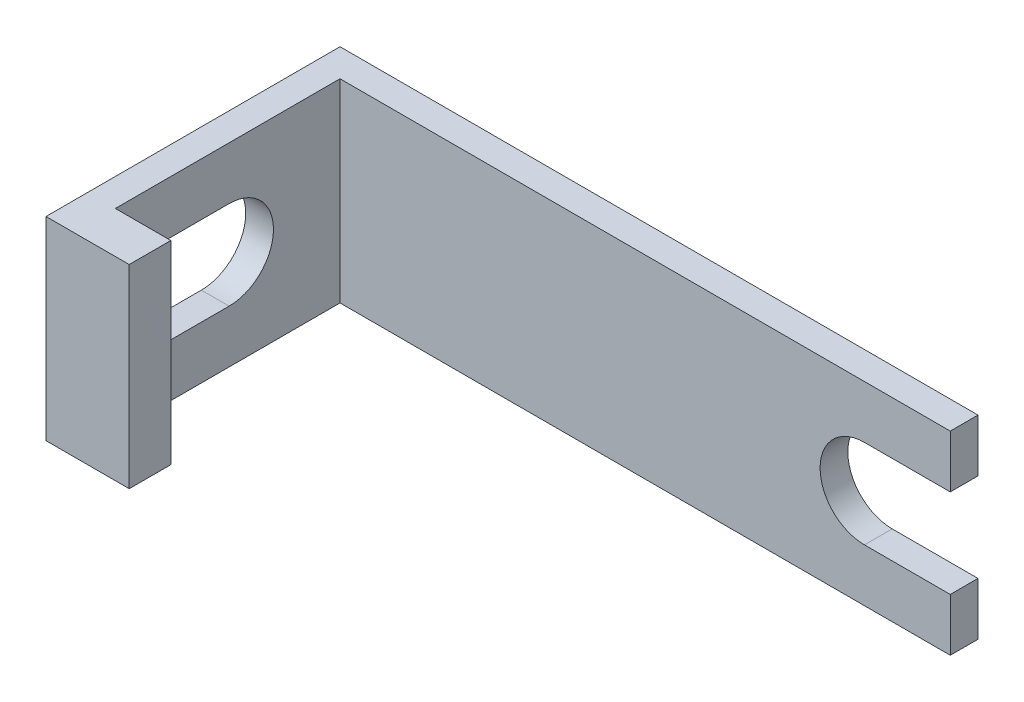
ISO-10303-21;
HEADER;
FILE_DESCRIPTION(('STEP AP214'),'2;1');
FILE_NAME('part.step','',(''),(''),'','','');
FILE_SCHEMA(('AUTOMOTIVE_DESIGN { 1 0 10303 214 1 1 1 1 }'));
ENDSEC;
DATA;
#1=APPLICATION_CONTEXT('core data for automotive mechanical design processes');
#2=APPLICATION_PROTOCOL_DEFINITION('international standard','automotive_design',2000,#1);
#3=PRODUCT_CONTEXT('',#1,'mechanical');
#4=PRODUCT('Part','Part','',(#3));
#5=PRODUCT_RELATED_PRODUCT_CATEGORY('part','',(#4));
#6=PRODUCT_DEFINITION_FORMATION('','',#4);
#7=PRODUCT_DEFINITION_CONTEXT('part definition',#1,'design');
#8=PRODUCT_DEFINITION('design','',#6,#7);
#9=PRODUCT_DEFINITION_SHAPE('','',#8);
#10=(LENGTH_UNIT() NAMED_UNIT(*) SI_UNIT(.MILLI.,.METRE.));
#11=(NAMED_UNIT(*) PLANE_ANGLE_UNIT() SI_UNIT($,.RADIAN.));
#12=(NAMED_UNIT(*) SI_UNIT($,.STERADIAN.) SOLID_ANGLE_UNIT());
#13=UNCERTAINTY_MEASURE_WITH_UNIT(LENGTH_MEASURE(1.E-05),#10,'distance_accuracy_value','');
#14=(GEOMETRIC_REPRESENTATION_CONTEXT(3) GLOBAL_UNCERTAINTY_ASSIGNED_CONTEXT((#13)) GLOBAL_UNIT_ASSIGNED_CONTEXT((#10,
#11,#12)) REPRESENTATION_CONTEXT('',''));
#15=CARTESIAN_POINT('',(0.,0.,0.));
#16=DIRECTION('',(0.,0.,1.));
#17=DIRECTION('',(1.,0.,0.));
#18=AXIS2_PLACEMENT_3D('',#15,#16,#17);
#19=CARTESIAN_POINT('',(12.700412833673,1.02264033263855,1.));
#20=DIRECTION('',(0.,0.,1.));
#21=DIRECTION('',(1.,0.,0.));
#22=AXIS2_PLACEMENT_3D('',#19,#20,#21);
#23=PLANE('',#22);
#24=DIRECTION('',(-1.,0.,0.));
#25=VECTOR('',#24,1.);
#26=CARTESIAN_POINT('',(15.7933647921131,4.52264033263895,1.));
#27=LINE('',#26,#25);
#28=CARTESIAN_POINT('',(15.7933647921131,4.52264033263895,1.));
#29=VERTEX_POINT('',#28);
#30=CARTESIAN_POINT('',(-6.20663520788689,4.52264033263895,1.));
#31=VERTEX_POINT('',#30);
#32=EDGE_CURVE('E219',#29,#31,#27,.T.);
#33=ORIENTED_EDGE('',*,*,#32,.T.);
#34=DIRECTION('',(0.,-1.,0.));
#35=VECTOR('',#34,1.);
#36=CARTESIAN_POINT('',(-6.20663520788689,1.02264033263854,1.));
#37=LINE('',#36,#35);
#38=CARTESIAN_POINT('',(-6.20663520788689,-2.47735966736105,1.));
#39=VERTEX_POINT('',#38);
#40=EDGE_CURVE('E216',#31,#39,#37,.T.);
#41=ORIENTED_EDGE('',*,*,#40,.T.);
#42=DIRECTION('',(1.,0.,0.));
#43=VECTOR('',#42,1.);
#44=CARTESIAN_POINT('',(-7.20663520788689,-2.47735966736105,1.));
#45=LINE('',#44,#43);
#46=CARTESIAN_POINT('',(15.7933647921131,-2.47735966736105,1.));
#47=VERTEX_POINT('',#46);
#48=EDGE_CURVE('E221',#39,#47,#45,.T.);
#49=ORIENTED_EDGE('',*,*,#48,.T.);
#50=DIRECTION('',(0.,1.,0.));
#51=VECTOR('',#50,1.);
#52=CARTESIAN_POINT('',(15.7933647921131,-0.577359667361056,1.));
#53=LINE('',#52,#51);
#54=CARTESIAN_POINT('',(15.7933647921131,-0.577359667361056,1.));
#55=VERTEX_POINT('',#54);
#56=EDGE_CURVE('E224',#47,#55,#53,.T.);
#57=ORIENTED_EDGE('',*,*,#56,.T.);
#58=DIRECTION('',(-1.,0.,0.));
#59=VECTOR('',#58,1.);
#60=CARTESIAN_POINT('',(13.620412833673,-0.577359667361056,1.));
#61=LINE('',#60,#59);
#62=CARTESIAN_POINT('',(12.700412833673,-0.577359667361056,1.));
#63=VERTEX_POINT('',#62);
#64=EDGE_CURVE('E226',#55,#63,#61,.T.);
#65=ORIENTED_EDGE('',*,*,#64,.T.);
#66=CARTESIAN_POINT('',(12.700412833673,1.02264033263855,1.));
#67=DIRECTION('',(0.,0.,-1.));
#68=DIRECTION('',(1.,0.,0.));
#69=AXIS2_PLACEMENT_3D('',#66,#67,#68);
#70=CIRCLE('',#69,1.5999999999996);
#71=CARTESIAN_POINT('',(12.700412833673,2.62264033263815,1.));
#72=VERTEX_POINT('',#71);
#73=EDGE_CURVE('E228',#63,#72,#70,.T.);
#74=ORIENTED_EDGE('',*,*,#73,.T.);
#75=DIRECTION('',(1.,0.,0.));
#76=VECTOR('',#75,1.);
#77=CARTESIAN_POINT('',(13.620412833673,2.62264033263815,1.));
#78=LINE('',#77,#76);
#79=CARTESIAN_POINT('',(15.7933647921131,2.62264033263815,1.));
#80=VERTEX_POINT('',#79);
#81=EDGE_CURVE('E230',#72,#80,#78,.T.);
#82=ORIENTED_EDGE('',*,*,#81,.T.);
#83=DIRECTION('',(0.,1.,0.));
#84=VECTOR('',#83,1.);
#85=CARTESIAN_POINT('',(15.7933647921131,4.52264033263895,1.));
#86=LINE('',#85,#84);
#87=EDGE_CURVE('E232',#80,#29,#86,.T.);
#88=ORIENTED_EDGE('',*,*,#87,.T.);
#89=EDGE_LOOP('',(#33,#41,#49,#57,#65,#74,#82,#88));
#90=FACE_BOUND('',#89,.T.);
#91=ADVANCED_FACE('F34',(#90),#23,.T.);
#92=CARTESIAN_POINT('',(15.7933647921131,4.52264033263895,1.));
#93=DIRECTION('',(0.,-1.,0.));
#94=DIRECTION('',(1.,0.,0.));
#95=AXIS2_PLACEMENT_3D('',#92,#93,#94);
#96=PLANE('',#95);
#97=DIRECTION('',(0.,0.,-1.));
#98=VECTOR('',#97,1.);
#99=CARTESIAN_POINT('',(-7.20663520788689,4.52264033263895,1.));
#100=LINE('',#99,#98);
#101=CARTESIAN_POINT('',(-7.20663520788689,4.52264033263895,10.6));
#102=VERTEX_POINT('',#101);
#103=CARTESIAN_POINT('',(-7.20663520788689,4.52264033263895,0.));
#104=VERTEX_POINT('',#103);
#105=EDGE_CURVE('E11',#102,#104,#100,.T.);
#106=ORIENTED_EDGE('',*,*,#105,.F.);
#107=DIRECTION('',(-1.,0.,0.));
#108=VECTOR('',#107,1.);
#109=CARTESIAN_POINT('',(-4.20663520788689,4.52264033263895,10.6));
#110=LINE('',#109,#108);
#111=CARTESIAN_POINT('',(-4.20663520788689,4.52264033263895,10.6));
#112=VERTEX_POINT('',#111);
#113=EDGE_CURVE('E200',#112,#102,#110,.T.);
#114=ORIENTED_EDGE('',*,*,#113,.F.);
#115=DIRECTION('',(0.,0.,-1.));
#116=VECTOR('',#115,1.);
#117=CARTESIAN_POINT('',(-4.20663520788689,4.52264033263895,9.1));
#118=LINE('',#117,#116);
#119=CARTESIAN_POINT('',(-4.20663520788689,4.52264033263895,9.1));
#120=VERTEX_POINT('',#119);
#121=EDGE_CURVE('E190',#112,#120,#118,.T.);
#122=ORIENTED_EDGE('',*,*,#121,.T.);
#123=DIRECTION('',(-1.,0.,0.));
#124=VECTOR('',#123,1.);
#125=CARTESIAN_POINT('',(-4.20663520788689,4.52264033263895,9.1));
#126=LINE('',#125,#124);
#127=CARTESIAN_POINT('',(-6.20663520788689,4.52264033263895,9.1));
#128=VERTEX_POINT('',#127);
#129=EDGE_CURVE('E196',#120,#128,#126,.T.);
#130=ORIENTED_EDGE('',*,*,#129,.T.);
#131=DIRECTION('',(0.,0.,-1.));
#132=VECTOR('',#131,1.);
#133=CARTESIAN_POINT('',(-6.20663520788689,4.52264033263895,0.));
#134=LINE('',#133,#132);
#135=EDGE_CURVE('E199',#128,#31,#134,.T.);
#136=ORIENTED_EDGE('',*,*,#135,.T.);
#137=ORIENTED_EDGE('',*,*,#32,.F.);
#138=DIRECTION('',(0.,0.,-1.));
#139=VECTOR('',#138,1.);
#140=CARTESIAN_POINT('',(15.7933647921131,4.52264033263895,1.));
#141=LINE('',#140,#139);
#142=CARTESIAN_POINT('',(15.7933647921131,4.52264033263895,0.));
#143=VERTEX_POINT('',#142);
#144=EDGE_CURVE('E234',#29,#143,#141,.T.);
#145=ORIENTED_EDGE('',*,*,#144,.T.);
#146=DIRECTION('',(-1.,0.,0.));
#147=VECTOR('',#146,1.);
#148=CARTESIAN_POINT('',(15.7933647921131,4.52264033263895,0.));
#149=LINE('',#148,#147);
#150=EDGE_CURVE('E218',#143,#104,#149,.T.);
#151=ORIENTED_EDGE('',*,*,#150,.T.);
#152=EDGE_LOOP('',(#106,#114,#122,#130,#136,#137,#145,#151));
#153=FACE_BOUND('',#152,.T.);
#154=ADVANCED_FACE('F36',(#153),#96,.F.);
#155=CARTESIAN_POINT('',(-7.20663520788689,4.52264033263895,1.));
#156=DIRECTION('',(1.,0.,0.));
#157=DIRECTION('',(0.,1.,0.));
#158=AXIS2_PLACEMENT_3D('',#155,#156,#157);
#159=PLANE('',#158);
#160=DIRECTION('',(0.,0.,-1.));
#161=VECTOR('',#160,1.);
#162=CARTESIAN_POINT('',(-7.20663520788689,2.62264033263895,7.5));
#163=LINE('',#162,#161);
#164=CARTESIAN_POINT('',(-7.20663520788689,2.62264033263895,7.5));
#165=VERTEX_POINT('',#164);
#166=CARTESIAN_POINT('',(-7.20663520788689,2.62264033263895,5.));
#167=VERTEX_POINT('',#166);
#168=EDGE_CURVE('E495',#165,#167,#163,.T.);
#169=ORIENTED_EDGE('',*,*,#168,.F.);
#170=CARTESIAN_POINT('',(-7.20663520788689,1.02264033263895,7.5));
#171=DIRECTION('',(1.,0.,0.));
#172=DIRECTION('',(0.,1.,0.));
#173=AXIS2_PLACEMENT_3D('',#170,#171,#172);
#174=CIRCLE('',#173,1.6);
#175=CARTESIAN_POINT('',(-7.20663520788689,-0.577359667361055,7.5));
#176=VERTEX_POINT('',#175);
#177=EDGE_CURVE('E180',#176,#165,#174,.F.);
#178=ORIENTED_EDGE('',*,*,#177,.F.);
#179=DIRECTION('',(0.,0.,1.));
#180=VECTOR('',#179,1.);
#181=CARTESIAN_POINT('',(-7.20663520788689,-0.577359667361055,7.5));
#182=LINE('',#181,#180);
#183=CARTESIAN_POINT('',(-7.20663520788689,-0.577359667361055,5.));
#184=VERTEX_POINT('',#183);
#185=EDGE_CURVE('E177',#184,#176,#182,.T.);
#186=ORIENTED_EDGE('',*,*,#185,.F.);
#187=CARTESIAN_POINT('',(-7.20663520788689,1.02264033263895,5.));
#188=DIRECTION('',(1.,0.,0.));
#189=DIRECTION('',(0.,1.,0.));
#190=AXIS2_PLACEMENT_3D('',#187,#188,#189);
#191=CIRCLE('',#190,1.6);
#192=EDGE_CURVE('E154',#167,#184,#191,.F.);
#193=ORIENTED_EDGE('',*,*,#192,.F.);
#194=EDGE_LOOP('',(#169,#178,#186,#193));
#195=FACE_BOUND('',#194,.T.);
#196=DIRECTION('',(0.,-1.,0.));
#197=VECTOR('',#196,1.);
#198=CARTESIAN_POINT('',(-7.20663520788689,4.52264033263895,0.));
#199=LINE('',#198,#197);
#200=CARTESIAN_POINT('',(-7.20663520788689,-2.47735966736105,0.));
#201=VERTEX_POINT('',#200);
#202=EDGE_CURVE('E236',#104,#201,#199,.T.);
#203=ORIENTED_EDGE('',*,*,#202,.T.);
#204=DIRECTION('',(0.,0.,-1.));
#205=VECTOR('',#204,1.);
#206=CARTESIAN_POINT('',(-7.20663520788689,-2.47735966736105,1.));
#207=LINE('',#206,#205);
#208=CARTESIAN_POINT('',(-7.20663520788689,-2.47735966736105,10.6));
#209=VERTEX_POINT('',#208);
#210=EDGE_CURVE('E42',#209,#201,#207,.T.);
#211=ORIENTED_EDGE('',*,*,#210,.F.);
#212=DIRECTION('',(0.,1.,0.));
#213=VECTOR('',#212,1.);
#214=CARTESIAN_POINT('',(-7.20663520788689,-2.47735966736105,10.6));
#215=LINE('',#214,#213);
#216=EDGE_CURVE('E179',#209,#102,#215,.T.);
#217=ORIENTED_EDGE('',*,*,#216,.T.);
#218=ORIENTED_EDGE('',*,*,#105,.T.);
#219=EDGE_LOOP('',(#203,#211,#217,#218));
#220=FACE_BOUND('',#219,.T.);
#221=ADVANCED_FACE('F308',(#195,#220),#159,.F.);
#222=CARTESIAN_POINT('',(-7.20663520788689,-2.47735966736105,1.));
#223=DIRECTION('',(0.,1.,0.));
#224=DIRECTION('',(-1.,0.,0.));
#225=AXIS2_PLACEMENT_3D('',#222,#223,#224);
#226=PLANE('',#225);
#227=DIRECTION('',(1.,0.,0.));
#228=VECTOR('',#227,1.);
#229=CARTESIAN_POINT('',(-7.20663520788689,-2.47735966736105,0.));
#230=LINE('',#229,#228);
#231=CARTESIAN_POINT('',(15.7933647921131,-2.47735966736105,0.));
#232=VERTEX_POINT('',#231);
#233=EDGE_CURVE('E238',#201,#232,#230,.T.);
#234=ORIENTED_EDGE('',*,*,#233,.T.);
#235=DIRECTION('',(0.,0.,-1.));
#236=VECTOR('',#235,1.);
#237=CARTESIAN_POINT('',(15.7933647921131,-2.47735966736105,1.));
#238=LINE('',#237,#236);
#239=EDGE_CURVE('E265',#47,#232,#238,.T.);
#240=ORIENTED_EDGE('',*,*,#239,.F.);
#241=ORIENTED_EDGE('',*,*,#48,.F.);
#242=DIRECTION('',(0.,0.,1.));
#243=VECTOR('',#242,1.);
#244=CARTESIAN_POINT('',(-6.20663520788689,-2.47735966736105,0.));
#245=LINE('',#244,#243);
#246=CARTESIAN_POINT('',(-6.20663520788689,-2.47735966736105,9.1));
#247=VERTEX_POINT('',#246);
#248=EDGE_CURVE('E210',#39,#247,#245,.T.);
#249=ORIENTED_EDGE('',*,*,#248,.T.);
#250=DIRECTION('',(-1.,0.,0.));
#251=VECTOR('',#250,1.);
#252=CARTESIAN_POINT('',(-4.20663520788689,-2.47735966736105,9.1));
#253=LINE('',#252,#251);
#254=CARTESIAN_POINT('',(-4.20663520788689,-2.47735966736105,9.1));
#255=VERTEX_POINT('',#254);
#256=EDGE_CURVE('E193',#255,#247,#253,.T.);
#257=ORIENTED_EDGE('',*,*,#256,.F.);
#258=DIRECTION('',(0.,0.,1.));
#259=VECTOR('',#258,1.);
#260=CARTESIAN_POINT('',(-4.20663520788689,-2.47735966736105,9.1));
#261=LINE('',#260,#259);
#262=CARTESIAN_POINT('',(-4.20663520788689,-2.47735966736105,10.6));
#263=VERTEX_POINT('',#262);
#264=EDGE_CURVE('E184',#255,#263,#261,.T.);
#265=ORIENTED_EDGE('',*,*,#264,.T.);
#266=DIRECTION('',(-1.,0.,0.));
#267=VECTOR('',#266,1.);
#268=CARTESIAN_POINT('',(-4.20663520788689,-2.47735966736105,10.6));
#269=LINE('',#268,#267);
#270=EDGE_CURVE('E203',#263,#209,#269,.T.);
#271=ORIENTED_EDGE('',*,*,#270,.T.);
#272=ORIENTED_EDGE('',*,*,#210,.T.);
#273=EDGE_LOOP('',(#234,#240,#241,#249,#257,#265,#271,#272));
#274=FACE_BOUND('',#273,.T.);
#275=ADVANCED_FACE('F270',(#274),#226,.F.);
#276=CARTESIAN_POINT('',(15.7933647921131,-0.577359667361056,1.));
#277=DIRECTION('',(-1.,0.,0.));
#278=DIRECTION('',(0.,0.,1.));
#279=AXIS2_PLACEMENT_3D('',#276,#277,#278);
#280=PLANE('',#279);
#281=DIRECTION('',(0.,1.,0.));
#282=VECTOR('',#281,1.);
#283=CARTESIAN_POINT('',(15.7933647921131,-0.577359667361056,0.));
#284=LINE('',#283,#282);
#285=CARTESIAN_POINT('',(15.7933647921131,-0.577359667361056,0.));
#286=VERTEX_POINT('',#285);
#287=EDGE_CURVE('E240',#232,#286,#284,.T.);
#288=ORIENTED_EDGE('',*,*,#287,.T.);
#289=DIRECTION('',(0.,0.,-1.));
#290=VECTOR('',#289,1.);
#291=CARTESIAN_POINT('',(15.7933647921131,-0.577359667361056,1.));
#292=LINE('',#291,#290);
#293=EDGE_CURVE('E262',#55,#286,#292,.T.);
#294=ORIENTED_EDGE('',*,*,#293,.F.);
#295=ORIENTED_EDGE('',*,*,#56,.F.);
#296=ORIENTED_EDGE('',*,*,#239,.T.);
#297=EDGE_LOOP('',(#288,#294,#295,#296));
#298=FACE_BOUND('',#297,.T.);
#299=ADVANCED_FACE('F282',(#298),#280,.F.);
#300=CARTESIAN_POINT('',(13.620412833673,-0.577359667361056,1.));
#301=DIRECTION('',(0.,-1.,0.));
#302=DIRECTION('',(1.,0.,0.));
#303=AXIS2_PLACEMENT_3D('',#300,#301,#302);
#304=PLANE('',#303);
#305=DIRECTION('',(-1.,0.,0.));
#306=VECTOR('',#305,1.);
#307=CARTESIAN_POINT('',(13.620412833673,-0.577359667361056,0.));
#308=LINE('',#307,#306);
#309=CARTESIAN_POINT('',(12.700412833673,-0.577359667361056,0.));
#310=VERTEX_POINT('',#309);
#311=EDGE_CURVE('E243',#286,#310,#308,.T.);
#312=ORIENTED_EDGE('',*,*,#311,.T.);
#313=DIRECTION('',(0.,0.,-1.));
#314=VECTOR('',#313,1.);
#315=CARTESIAN_POINT('',(12.700412833673,-0.577359667361056,1.));
#316=LINE('',#315,#314);
#317=EDGE_CURVE('E259',#63,#310,#316,.T.);
#318=ORIENTED_EDGE('',*,*,#317,.F.);
#319=ORIENTED_EDGE('',*,*,#64,.F.);
#320=ORIENTED_EDGE('',*,*,#293,.T.);
#321=EDGE_LOOP('',(#312,#318,#319,#320));
#322=FACE_BOUND('',#321,.T.);
#323=ADVANCED_FACE('F286',(#322),#304,.F.);
#324=CARTESIAN_POINT('',(12.700412833673,1.02264033263855,1.));
#325=DIRECTION('',(0.,0.,-1.));
#326=DIRECTION('',(-1.,0.,0.));
#327=AXIS2_PLACEMENT_3D('',#324,#325,#326);
#328=CYLINDRICAL_SURFACE('',#327,1.5999999999996);
#329=CARTESIAN_POINT('',(12.700412833673,1.02264033263855,0.));
#330=DIRECTION('',(0.,0.,-1.));
#331=DIRECTION('',(1.,0.,0.));
#332=AXIS2_PLACEMENT_3D('',#329,#330,#331);
#333=CIRCLE('',#332,1.5999999999996);
#334=CARTESIAN_POINT('',(12.700412833673,2.62264033263815,0.));
#335=VERTEX_POINT('',#334);
#336=EDGE_CURVE('E245',#310,#335,#333,.T.);
#337=ORIENTED_EDGE('',*,*,#336,.T.);
#338=DIRECTION('',(0.,0.,-1.));
#339=VECTOR('',#338,1.);
#340=CARTESIAN_POINT('',(12.700412833673,2.62264033263815,1.));
#341=LINE('',#340,#339);
#342=EDGE_CURVE('E256',#72,#335,#341,.T.);
#343=ORIENTED_EDGE('',*,*,#342,.F.);
#344=ORIENTED_EDGE('',*,*,#73,.F.);
#345=ORIENTED_EDGE('',*,*,#317,.T.);
#346=EDGE_LOOP('',(#337,#343,#344,#345));
#347=FACE_BOUND('',#346,.T.);
#348=ADVANCED_FACE('F321',(#347),#328,.F.);
#349=CARTESIAN_POINT('',(13.620412833673,2.62264033263815,1.));
#350=DIRECTION('',(0.,1.,0.));
#351=DIRECTION('',(0.,0.,1.));
#352=AXIS2_PLACEMENT_3D('',#349,#350,#351);
#353=PLANE('',#352);
#354=DIRECTION('',(1.,0.,0.));
#355=VECTOR('',#354,1.);
#356=CARTESIAN_POINT('',(13.620412833673,2.62264033263815,0.));
#357=LINE('',#356,#355);
#358=CARTESIAN_POINT('',(15.7933647921131,2.62264033263815,0.));
#359=VERTEX_POINT('',#358);
#360=EDGE_CURVE('E248',#335,#359,#357,.T.);
#361=ORIENTED_EDGE('',*,*,#360,.T.);
#362=DIRECTION('',(0.,0.,-1.));
#363=VECTOR('',#362,1.);
#364=CARTESIAN_POINT('',(15.7933647921131,2.62264033263815,1.));
#365=LINE('',#364,#363);
#366=EDGE_CURVE('E253',#80,#359,#365,.T.);
#367=ORIENTED_EDGE('',*,*,#366,.F.);
#368=ORIENTED_EDGE('',*,*,#81,.F.);
#369=ORIENTED_EDGE('',*,*,#342,.T.);
#370=EDGE_LOOP('',(#361,#367,#368,#369));
#371=FACE_BOUND('',#370,.T.);
#372=ADVANCED_FACE('F319',(#371),#353,.F.);
#373=CARTESIAN_POINT('',(15.7933647921131,4.52264033263895,1.));
#374=DIRECTION('',(-1.,0.,0.));
#375=DIRECTION('',(0.,0.,1.));
#376=AXIS2_PLACEMENT_3D('',#373,#374,#375);
#377=PLANE('',#376);
#378=DIRECTION('',(0.,1.,0.));
#379=VECTOR('',#378,1.);
#380=CARTESIAN_POINT('',(15.7933647921131,4.52264033263895,0.));
#381=LINE('',#380,#379);
#382=EDGE_CURVE('E222',#359,#143,#381,.T.);
#383=ORIENTED_EDGE('',*,*,#382,.T.);
#384=ORIENTED_EDGE('',*,*,#144,.F.);
#385=ORIENTED_EDGE('',*,*,#87,.F.);
#386=ORIENTED_EDGE('',*,*,#366,.T.);
#387=EDGE_LOOP('',(#383,#384,#385,#386));
#388=FACE_BOUND('',#387,.T.);
#389=ADVANCED_FACE('F314',(#388),#377,.F.);
#390=CARTESIAN_POINT('',(12.700412833673,1.02264033263855,0.));
#391=DIRECTION('',(0.,0.,1.));
#392=DIRECTION('',(1.,0.,0.));
#393=AXIS2_PLACEMENT_3D('',#390,#391,#392);
#394=PLANE('',#393);
#395=ORIENTED_EDGE('',*,*,#202,.F.);
#396=ORIENTED_EDGE('',*,*,#150,.F.);
#397=ORIENTED_EDGE('',*,*,#382,.F.);
#398=ORIENTED_EDGE('',*,*,#360,.F.);
#399=ORIENTED_EDGE('',*,*,#336,.F.);
#400=ORIENTED_EDGE('',*,*,#311,.F.);
#401=ORIENTED_EDGE('',*,*,#287,.F.);
#402=ORIENTED_EDGE('',*,*,#233,.F.);
#403=EDGE_LOOP('',(#395,#396,#397,#398,#399,#400,#401,#402));
#404=FACE_BOUND('',#403,.T.);
#405=ADVANCED_FACE('F277',(#404),#394,.F.);
#406=CARTESIAN_POINT('',(-6.20663520788689,0.,0.));
#407=DIRECTION('',(-1.,0.,0.));
#408=DIRECTION('',(0.,-1.,0.));
#409=AXIS2_PLACEMENT_3D('',#406,#407,#408);
#410=PLANE('',#409);
#411=DIRECTION('',(0.,0.,-1.));
#412=VECTOR('',#411,1.);
#413=CARTESIAN_POINT('',(-6.20663520788689,-0.577359667361054,7.5));
#414=LINE('',#413,#412);
#415=CARTESIAN_POINT('',(-6.20663520788689,-0.577359667361054,7.5));
#416=VERTEX_POINT('',#415);
#417=CARTESIAN_POINT('',(-6.20663520788689,-0.577359667361055,5.));
#418=VERTEX_POINT('',#417);
#419=EDGE_CURVE('E159',#416,#418,#414,.T.);
#420=ORIENTED_EDGE('',*,*,#419,.F.);
#421=CARTESIAN_POINT('',(-6.20663520788689,1.02264033263895,7.5));
#422=DIRECTION('',(1.,0.,0.));
#423=DIRECTION('',(0.,1.,0.));
#424=AXIS2_PLACEMENT_3D('',#421,#422,#423);
#425=CIRCLE('',#424,1.6);
#426=CARTESIAN_POINT('',(-6.20663520788689,1.02264033263895,9.1));
#427=VERTEX_POINT('',#426);
#428=EDGE_CURVE('E296',#427,#416,#425,.T.);
#429=ORIENTED_EDGE('',*,*,#428,.F.);
#430=DIRECTION('',(0.,1.,0.));
#431=VECTOR('',#430,1.);
#432=CARTESIAN_POINT('',(-6.20663520788689,-2.47735966736105,9.1));
#433=LINE('',#432,#431);
#434=EDGE_CURVE('E213',#247,#427,#433,.T.);
#435=ORIENTED_EDGE('',*,*,#434,.F.);
#436=ORIENTED_EDGE('',*,*,#248,.F.);
#437=ORIENTED_EDGE('',*,*,#40,.F.);
#438=ORIENTED_EDGE('',*,*,#135,.F.);
#439=EDGE_CURVE('E212',#427,#128,#433,.T.);
#440=ORIENTED_EDGE('',*,*,#439,.F.);
#441=CARTESIAN_POINT('',(-6.20663520788689,2.62264033263895,7.5));
#442=VERTEX_POINT('',#441);
#443=EDGE_CURVE('E163',#442,#427,#425,.T.);
#444=ORIENTED_EDGE('',*,*,#443,.F.);
#445=DIRECTION('',(0.,0.,1.));
#446=VECTOR('',#445,1.);
#447=CARTESIAN_POINT('',(-6.20663520788689,2.62264033263895,7.5));
#448=LINE('',#447,#446);
#449=CARTESIAN_POINT('',(-6.20663520788689,2.62264033263895,5.));
#450=VERTEX_POINT('',#449);
#451=EDGE_CURVE('E168',#450,#442,#448,.T.);
#452=ORIENTED_EDGE('',*,*,#451,.F.);
#453=CARTESIAN_POINT('',(-6.20663520788689,1.02264033263895,5.));
#454=DIRECTION('',(1.,0.,0.));
#455=DIRECTION('',(0.,1.,0.));
#456=AXIS2_PLACEMENT_3D('',#453,#454,#455);
#457=CIRCLE('',#456,1.6);
#458=EDGE_CURVE('E151',#418,#450,#457,.T.);
#459=ORIENTED_EDGE('',*,*,#458,.F.);
#460=EDGE_LOOP('',(#420,#429,#435,#436,#437,#438,#440,#444,#452,#459));
#461=FACE_BOUND('',#460,.T.);
#462=ADVANCED_FACE('F165',(#461),#410,.F.);
#463=CARTESIAN_POINT('',(-4.20663520788689,-2.47735966736105,9.1));
#464=DIRECTION('',(0.,0.,-1.));
#465=DIRECTION('',(-1.,0.,0.));
#466=AXIS2_PLACEMENT_3D('',#463,#464,#465);
#467=PLANE('',#466);
#468=ORIENTED_EDGE('',*,*,#256,.T.);
#469=ORIENTED_EDGE('',*,*,#434,.T.);
#470=ORIENTED_EDGE('',*,*,#439,.T.);
#471=ORIENTED_EDGE('',*,*,#129,.F.);
#472=DIRECTION('',(0.,-1.,0.));
#473=VECTOR('',#472,1.);
#474=CARTESIAN_POINT('',(-4.20663520788689,-2.47735966736105,9.1));
#475=LINE('',#474,#473);
#476=EDGE_CURVE('E181',#120,#255,#475,.T.);
#477=ORIENTED_EDGE('',*,*,#476,.T.);
#478=EDGE_LOOP('',(#468,#469,#470,#471,#477));
#479=FACE_BOUND('',#478,.T.);
#480=ADVANCED_FACE('F299',(#479),#467,.T.);
#481=CARTESIAN_POINT('',(-4.20663520788689,-2.47735966736105,10.6));
#482=DIRECTION('',(0.,0.,1.));
#483=DIRECTION('',(1.,0.,0.));
#484=AXIS2_PLACEMENT_3D('',#481,#482,#483);
#485=PLANE('',#484);
#486=ORIENTED_EDGE('',*,*,#216,.F.);
#487=ORIENTED_EDGE('',*,*,#270,.F.);
#488=DIRECTION('',(0.,1.,0.));
#489=VECTOR('',#488,1.);
#490=CARTESIAN_POINT('',(-4.20663520788689,-2.47735966736105,10.6));
#491=LINE('',#490,#489);
#492=EDGE_CURVE('E187',#263,#112,#491,.T.);
#493=ORIENTED_EDGE('',*,*,#492,.T.);
#494=ORIENTED_EDGE('',*,*,#113,.T.);
#495=EDGE_LOOP('',(#486,#487,#493,#494));
#496=FACE_BOUND('',#495,.T.);
#497=ADVANCED_FACE('F307',(#496),#485,.T.);
#498=CARTESIAN_POINT('',(-4.20663520788689,0.,0.));
#499=DIRECTION('',(1.,0.,0.));
#500=DIRECTION('',(0.,1.,0.));
#501=AXIS2_PLACEMENT_3D('',#498,#499,#500);
#502=PLANE('',#501);
#503=ORIENTED_EDGE('',*,*,#476,.F.);
#504=ORIENTED_EDGE('',*,*,#121,.F.);
#505=ORIENTED_EDGE('',*,*,#492,.F.);
#506=ORIENTED_EDGE('',*,*,#264,.F.);
#507=EDGE_LOOP('',(#503,#504,#505,#506));
#508=FACE_BOUND('',#507,.T.);
#509=ADVANCED_FACE('F304',(#508),#502,.T.);
#510=CARTESIAN_POINT('',(-13.7434540060486,1.02264033263894,7.5));
#511=DIRECTION('',(1.,0.,0.));
#512=DIRECTION('',(0.,1.,0.));
#513=AXIS2_PLACEMENT_3D('',#510,#511,#512);
#514=CYLINDRICAL_SURFACE('',#513,1.6);
#515=ORIENTED_EDGE('',*,*,#177,.T.);
#516=DIRECTION('',(1.,0.,0.));
#517=VECTOR('',#516,1.);
#518=CARTESIAN_POINT('',(-13.7434540060486,2.62264033263894,7.5));
#519=LINE('',#518,#517);
#520=EDGE_CURVE('E173',#165,#442,#519,.T.);
#521=ORIENTED_EDGE('',*,*,#520,.T.);
#522=ORIENTED_EDGE('',*,*,#443,.T.);
#523=ORIENTED_EDGE('',*,*,#428,.T.);
#524=DIRECTION('',(1.,0.,0.));
#525=VECTOR('',#524,1.);
#526=CARTESIAN_POINT('',(-13.7434540060486,-0.577359667361055,7.5));
#527=LINE('',#526,#525);
#528=EDGE_CURVE('E54',#176,#416,#527,.T.);
#529=ORIENTED_EDGE('',*,*,#528,.F.);
#530=EDGE_LOOP('',(#515,#521,#522,#523,#529));
#531=FACE_BOUND('',#530,.T.);
#532=ADVANCED_FACE('F375',(#531),#514,.F.);
#533=CARTESIAN_POINT('',(-13.7434540060486,2.62264033263894,7.5));
#534=DIRECTION('',(0.,1.,0.));
#535=DIRECTION('',(-1.,0.,0.));
#536=AXIS2_PLACEMENT_3D('',#533,#534,#535);
#537=PLANE('',#536);
#538=ORIENTED_EDGE('',*,*,#168,.T.);
#539=DIRECTION('',(1.,0.,0.));
#540=VECTOR('',#539,1.);
#541=CARTESIAN_POINT('',(-13.7434540060486,2.62264033263894,5.));
#542=LINE('',#541,#540);
#543=EDGE_CURVE('E156',#167,#450,#542,.T.);
#544=ORIENTED_EDGE('',*,*,#543,.T.);
#545=ORIENTED_EDGE('',*,*,#451,.T.);
#546=ORIENTED_EDGE('',*,*,#520,.F.);
#547=EDGE_LOOP('',(#538,#544,#545,#546));
#548=FACE_BOUND('',#547,.T.);
#549=ADVANCED_FACE('F381',(#548),#537,.F.);
#550=CARTESIAN_POINT('',(-13.7434540060486,1.02264033263894,5.));
#551=DIRECTION('',(1.,0.,0.));
#552=DIRECTION('',(0.,1.,0.));
#553=AXIS2_PLACEMENT_3D('',#550,#551,#552);
#554=CYLINDRICAL_SURFACE('',#553,1.6);
#555=ORIENTED_EDGE('',*,*,#192,.T.);
#556=DIRECTION('',(1.,0.,0.));
#557=VECTOR('',#556,1.);
#558=CARTESIAN_POINT('',(-13.7434540060486,-0.577359667361056,5.));
#559=LINE('',#558,#557);
#560=EDGE_CURVE('E49',#184,#418,#559,.T.);
#561=ORIENTED_EDGE('',*,*,#560,.T.);
#562=ORIENTED_EDGE('',*,*,#458,.T.);
#563=ORIENTED_EDGE('',*,*,#543,.F.);
#564=EDGE_LOOP('',(#555,#561,#562,#563));
#565=FACE_BOUND('',#564,.T.);
#566=ADVANCED_FACE('F148',(#565),#554,.F.);
#567=CARTESIAN_POINT('',(-13.7434540060486,-0.577359667361055,7.5));
#568=DIRECTION('',(0.,-1.,0.));
#569=DIRECTION('',(0.,0.,-1.));
#570=AXIS2_PLACEMENT_3D('',#567,#568,#569);
#571=PLANE('',#570);
#572=ORIENTED_EDGE('',*,*,#185,.T.);
#573=ORIENTED_EDGE('',*,*,#528,.T.);
#574=ORIENTED_EDGE('',*,*,#419,.T.);
#575=ORIENTED_EDGE('',*,*,#560,.F.);
#576=EDGE_LOOP('',(#572,#573,#574,#575));
#577=FACE_BOUND('',#576,.T.);
#578=ADVANCED_FACE('F160',(#577),#571,.F.);
#579=CLOSED_SHELL('',(#91,#154,#221,#275,#299,#323,#348,#372,#389,#405,#462,#480,#497,#509,#532,
#549,#566,#578));
#580=MANIFOLD_SOLID_BREP('B2',#579);
#581=ADVANCED_BREP_SHAPE_REPRESENTATION('',(#18,#580),#14);
#582=SHAPE_DEFINITION_REPRESENTATION(#9,#581);
ENDSEC;
END-ISO-10303-21;
